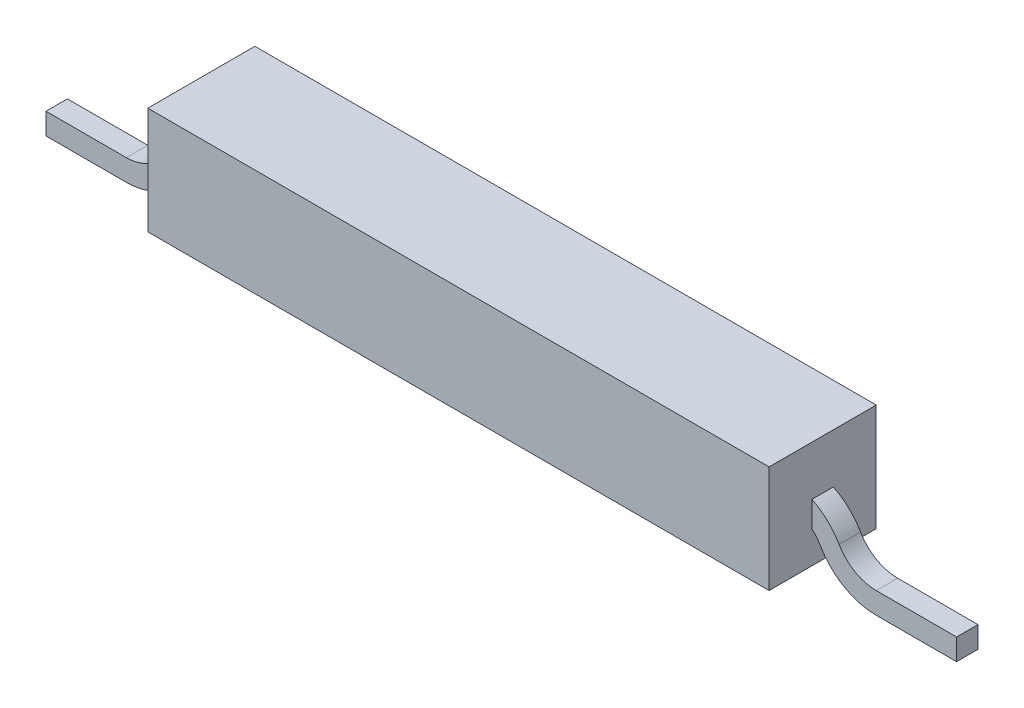
ISO-10303-21;
HEADER;
FILE_DESCRIPTION(('STEP AP214'),'2;1');
FILE_NAME('part.step','',(''),(''),'','','');
FILE_SCHEMA(('AUTOMOTIVE_DESIGN { 1 0 10303 214 1 1 1 1 }'));
ENDSEC;
DATA;
#1=APPLICATION_CONTEXT('core data for automotive mechanical design processes');
#2=APPLICATION_PROTOCOL_DEFINITION('international standard','automotive_design',2000,#1);
#3=PRODUCT_CONTEXT('',#1,'mechanical');
#4=PRODUCT('Part','Part','',(#3));
#5=PRODUCT_RELATED_PRODUCT_CATEGORY('part','',(#4));
#6=PRODUCT_DEFINITION_FORMATION('','',#4);
#7=PRODUCT_DEFINITION_CONTEXT('part definition',#1,'design');
#8=PRODUCT_DEFINITION('design','',#6,#7);
#9=PRODUCT_DEFINITION_SHAPE('','',#8);
#10=(LENGTH_UNIT() NAMED_UNIT(*) SI_UNIT(.MILLI.,.METRE.));
#11=(NAMED_UNIT(*) PLANE_ANGLE_UNIT() SI_UNIT($,.RADIAN.));
#12=(NAMED_UNIT(*) SI_UNIT($,.STERADIAN.) SOLID_ANGLE_UNIT());
#13=UNCERTAINTY_MEASURE_WITH_UNIT(LENGTH_MEASURE(1.E-05),#10,'distance_accuracy_value','');
#14=(GEOMETRIC_REPRESENTATION_CONTEXT(3) GLOBAL_UNCERTAINTY_ASSIGNED_CONTEXT((#13)) GLOBAL_UNIT_ASSIGNED_CONTEXT((#10,
#11,#12)) REPRESENTATION_CONTEXT('',''));
#15=CARTESIAN_POINT('',(0.,0.,0.));
#16=DIRECTION('',(0.,0.,1.));
#17=DIRECTION('',(1.,0.,0.));
#18=AXIS2_PLACEMENT_3D('',#15,#16,#17);
#19=CARTESIAN_POINT('',(5.8,-1.,-1.));
#20=DIRECTION('',(0.,0.,1.));
#21=DIRECTION('',(1.,0.,0.));
#22=AXIS2_PLACEMENT_3D('',#19,#20,#21);
#23=PLANE('',#22);
#24=DIRECTION('',(0.,1.,0.));
#25=VECTOR('',#24,1.);
#26=CARTESIAN_POINT('',(-5.8,-1.,-1.));
#27=LINE('',#26,#25);
#28=CARTESIAN_POINT('',(-5.8,-1.,-1.));
#29=VERTEX_POINT('',#28);
#30=CARTESIAN_POINT('',(-5.8,1.,-1.));
#31=VERTEX_POINT('',#30);
#32=EDGE_CURVE('E280',#29,#31,#27,.T.);
#33=ORIENTED_EDGE('',*,*,#32,.T.);
#34=DIRECTION('',(-1.,0.,0.));
#35=VECTOR('',#34,1.);
#36=CARTESIAN_POINT('',(5.8,1.,-1.));
#37=LINE('',#36,#35);
#38=CARTESIAN_POINT('',(5.8,1.,-1.));
#39=VERTEX_POINT('',#38);
#40=EDGE_CURVE('E307',#39,#31,#37,.T.);
#41=ORIENTED_EDGE('',*,*,#40,.F.);
#42=DIRECTION('',(0.,1.,0.));
#43=VECTOR('',#42,1.);
#44=CARTESIAN_POINT('',(5.8,-1.,-1.));
#45=LINE('',#44,#43);
#46=CARTESIAN_POINT('',(5.8,-1.,-1.));
#47=VERTEX_POINT('',#46);
#48=EDGE_CURVE('E281',#47,#39,#45,.T.);
#49=ORIENTED_EDGE('',*,*,#48,.F.);
#50=DIRECTION('',(-1.,0.,0.));
#51=VECTOR('',#50,1.);
#52=CARTESIAN_POINT('',(5.8,-1.,-1.));
#53=LINE('',#52,#51);
#54=EDGE_CURVE('E291',#47,#29,#53,.T.);
#55=ORIENTED_EDGE('',*,*,#54,.T.);
#56=EDGE_LOOP('',(#33,#41,#49,#55));
#57=FACE_BOUND('',#56,.T.);
#58=ADVANCED_FACE('F33',(#57),#23,.F.);
#59=CARTESIAN_POINT('',(5.8,1.,1.));
#60=DIRECTION('',(0.,-1.,0.));
#61=DIRECTION('',(0.,0.,-1.));
#62=AXIS2_PLACEMENT_3D('',#59,#60,#61);
#63=PLANE('',#62);
#64=DIRECTION('',(0.,0.,1.));
#65=VECTOR('',#64,1.);
#66=CARTESIAN_POINT('',(-5.8,1.,1.));
#67=LINE('',#66,#65);
#68=CARTESIAN_POINT('',(-5.8,1.,1.));
#69=VERTEX_POINT('',#68);
#70=EDGE_CURVE('E294',#31,#69,#67,.T.);
#71=ORIENTED_EDGE('',*,*,#70,.T.);
#72=DIRECTION('',(-1.,0.,0.));
#73=VECTOR('',#72,1.);
#74=CARTESIAN_POINT('',(5.8,1.,1.));
#75=LINE('',#74,#73);
#76=CARTESIAN_POINT('',(5.8,1.,1.));
#77=VERTEX_POINT('',#76);
#78=EDGE_CURVE('E304',#77,#69,#75,.T.);
#79=ORIENTED_EDGE('',*,*,#78,.F.);
#80=DIRECTION('',(0.,0.,1.));
#81=VECTOR('',#80,1.);
#82=CARTESIAN_POINT('',(5.8,1.,1.));
#83=LINE('',#82,#81);
#84=EDGE_CURVE('E284',#39,#77,#83,.T.);
#85=ORIENTED_EDGE('',*,*,#84,.F.);
#86=ORIENTED_EDGE('',*,*,#40,.T.);
#87=EDGE_LOOP('',(#71,#79,#85,#86));
#88=FACE_BOUND('',#87,.T.);
#89=ADVANCED_FACE('F359',(#88),#63,.F.);
#90=CARTESIAN_POINT('',(5.8,-1.,1.));
#91=DIRECTION('',(0.,0.,-1.));
#92=DIRECTION('',(-1.,0.,0.));
#93=AXIS2_PLACEMENT_3D('',#90,#91,#92);
#94=PLANE('',#93);
#95=DIRECTION('',(0.,-1.,0.));
#96=VECTOR('',#95,1.);
#97=CARTESIAN_POINT('',(-5.8,-1.,1.));
#98=LINE('',#97,#96);
#99=CARTESIAN_POINT('',(-5.8,-1.,1.));
#100=VERTEX_POINT('',#99);
#101=EDGE_CURVE('E296',#69,#100,#98,.T.);
#102=ORIENTED_EDGE('',*,*,#101,.T.);
#103=DIRECTION('',(-1.,0.,0.));
#104=VECTOR('',#103,1.);
#105=CARTESIAN_POINT('',(5.8,-1.,1.));
#106=LINE('',#105,#104);
#107=CARTESIAN_POINT('',(5.8,-1.,1.));
#108=VERTEX_POINT('',#107);
#109=EDGE_CURVE('E301',#108,#100,#106,.T.);
#110=ORIENTED_EDGE('',*,*,#109,.F.);
#111=DIRECTION('',(0.,-1.,0.));
#112=VECTOR('',#111,1.);
#113=CARTESIAN_POINT('',(5.8,-1.,1.));
#114=LINE('',#113,#112);
#115=EDGE_CURVE('E287',#77,#108,#114,.T.);
#116=ORIENTED_EDGE('',*,*,#115,.F.);
#117=ORIENTED_EDGE('',*,*,#78,.T.);
#118=EDGE_LOOP('',(#102,#110,#116,#117));
#119=FACE_BOUND('',#118,.T.);
#120=ADVANCED_FACE('F364',(#119),#94,.F.);
#121=CARTESIAN_POINT('',(5.8,-1.,1.));
#122=DIRECTION('',(0.,1.,0.));
#123=DIRECTION('',(0.,0.,1.));
#124=AXIS2_PLACEMENT_3D('',#121,#122,#123);
#125=PLANE('',#124);
#126=DIRECTION('',(0.,0.,-1.));
#127=VECTOR('',#126,1.);
#128=CARTESIAN_POINT('',(-5.8,-1.,1.));
#129=LINE('',#128,#127);
#130=EDGE_CURVE('E285',#100,#29,#129,.T.);
#131=ORIENTED_EDGE('',*,*,#130,.T.);
#132=ORIENTED_EDGE('',*,*,#54,.F.);
#133=DIRECTION('',(0.,0.,-1.));
#134=VECTOR('',#133,1.);
#135=CARTESIAN_POINT('',(5.8,-1.,1.));
#136=LINE('',#135,#134);
#137=EDGE_CURVE('E289',#108,#47,#136,.T.);
#138=ORIENTED_EDGE('',*,*,#137,.F.);
#139=ORIENTED_EDGE('',*,*,#109,.T.);
#140=EDGE_LOOP('',(#131,#132,#138,#139));
#141=FACE_BOUND('',#140,.T.);
#142=ADVANCED_FACE('F379',(#141),#125,.F.);
#143=CARTESIAN_POINT('',(5.8,0.,0.));
#144=DIRECTION('',(-1.,0.,0.));
#145=DIRECTION('',(0.,0.,1.));
#146=AXIS2_PLACEMENT_3D('',#143,#144,#145);
#147=PLANE('',#146);
#148=DIRECTION('',(0.,0.,1.));
#149=VECTOR('',#148,1.);
#150=CARTESIAN_POINT('',(5.8,-0.402570558002616,0.));
#151=LINE('',#150,#149);
#152=CARTESIAN_POINT('',(5.8,-0.402570558002616,0.2));
#153=VERTEX_POINT('',#152);
#154=CARTESIAN_POINT('',(5.8,-0.402570558002616,-0.2));
#155=VERTEX_POINT('',#154);
#156=EDGE_CURVE('E40',#153,#155,#151,.F.);
#157=ORIENTED_EDGE('',*,*,#156,.F.);
#158=DIRECTION('',(0.,1.,0.));
#159=VECTOR('',#158,1.);
#160=CARTESIAN_POINT('',(5.8,0.,0.2));
#161=LINE('',#160,#159);
#162=CARTESIAN_POINT('',(5.8,0.0756030579006828,0.2));
#163=VERTEX_POINT('',#162);
#164=EDGE_CURVE('E277',#153,#163,#161,.T.);
#165=ORIENTED_EDGE('',*,*,#164,.T.);
#166=DIRECTION('',(0.,0.,1.));
#167=VECTOR('',#166,1.);
#168=CARTESIAN_POINT('',(5.8,0.0756030579006828,0.));
#169=LINE('',#168,#167);
#170=CARTESIAN_POINT('',(5.8,0.0756030579006828,-0.2));
#171=VERTEX_POINT('',#170);
#172=EDGE_CURVE('E11',#171,#163,#169,.T.);
#173=ORIENTED_EDGE('',*,*,#172,.F.);
#174=DIRECTION('',(0.,-1.,0.));
#175=VECTOR('',#174,1.);
#176=CARTESIAN_POINT('',(5.8,0.,-0.2));
#177=LINE('',#176,#175);
#178=EDGE_CURVE('E274',#171,#155,#177,.T.);
#179=ORIENTED_EDGE('',*,*,#178,.T.);
#180=EDGE_LOOP('',(#157,#165,#173,#179));
#181=FACE_BOUND('',#180,.T.);
#182=ORIENTED_EDGE('',*,*,#48,.T.);
#183=ORIENTED_EDGE('',*,*,#84,.T.);
#184=ORIENTED_EDGE('',*,*,#115,.T.);
#185=ORIENTED_EDGE('',*,*,#137,.T.);
#186=EDGE_LOOP('',(#182,#183,#184,#185));
#187=FACE_BOUND('',#186,.T.);
#188=ADVANCED_FACE('F322',(#181,#187),#147,.F.);
#189=CARTESIAN_POINT('',(-5.8,0.,0.));
#190=DIRECTION('',(-1.,0.,0.));
#191=DIRECTION('',(0.,0.,1.));
#192=AXIS2_PLACEMENT_3D('',#189,#190,#191);
#193=PLANE('',#192);
#194=DIRECTION('',(0.,1.,0.));
#195=VECTOR('',#194,1.);
#196=CARTESIAN_POINT('',(-5.8,0.,0.2));
#197=LINE('',#196,#195);
#198=CARTESIAN_POINT('',(-5.8,-0.402570558002618,0.2));
#199=VERTEX_POINT('',#198);
#200=CARTESIAN_POINT('',(-5.8,0.0756030579006813,0.2));
#201=VERTEX_POINT('',#200);
#202=EDGE_CURVE('E316',#199,#201,#197,.T.);
#203=ORIENTED_EDGE('',*,*,#202,.F.);
#204=DIRECTION('',(0.,0.,1.));
#205=VECTOR('',#204,1.);
#206=CARTESIAN_POINT('',(-5.8,-0.402570558002618,0.));
#207=LINE('',#206,#205);
#208=CARTESIAN_POINT('',(-5.8,-0.402570558002618,-0.2));
#209=VERTEX_POINT('',#208);
#210=EDGE_CURVE('E313',#199,#209,#207,.F.);
#211=ORIENTED_EDGE('',*,*,#210,.T.);
#212=DIRECTION('',(0.,-1.,0.));
#213=VECTOR('',#212,1.);
#214=CARTESIAN_POINT('',(-5.8,0.,-0.2));
#215=LINE('',#214,#213);
#216=CARTESIAN_POINT('',(-5.8,0.0756030579006813,-0.2));
#217=VERTEX_POINT('',#216);
#218=EDGE_CURVE('E310',#217,#209,#215,.T.);
#219=ORIENTED_EDGE('',*,*,#218,.F.);
#220=DIRECTION('',(0.,0.,1.));
#221=VECTOR('',#220,1.);
#222=CARTESIAN_POINT('',(-5.8,0.0756030579006813,0.));
#223=LINE('',#222,#221);
#224=EDGE_CURVE('E55',#217,#201,#223,.T.);
#225=ORIENTED_EDGE('',*,*,#224,.T.);
#226=EDGE_LOOP('',(#203,#211,#219,#225));
#227=FACE_BOUND('',#226,.T.);
#228=ORIENTED_EDGE('',*,*,#32,.F.);
#229=ORIENTED_EDGE('',*,*,#130,.F.);
#230=ORIENTED_EDGE('',*,*,#101,.F.);
#231=ORIENTED_EDGE('',*,*,#70,.F.);
#232=EDGE_LOOP('',(#228,#229,#230,#231));
#233=FACE_BOUND('',#232,.T.);
#234=ADVANCED_FACE('F372',(#227,#233),#193,.T.);
#235=CARTESIAN_POINT('',(-7.,0.,0.));
#236=DIRECTION('',(0.,0.,-1.));
#237=DIRECTION('',(-1.,0.,0.));
#238=AXIS2_PLACEMENT_3D('',#235,#236,#237);
#239=CYLINDRICAL_SURFACE('',#238,0.8);
#240=DIRECTION('',(0.,0.,1.));
#241=VECTOR('',#240,1.);
#242=CARTESIAN_POINT('',(-6.30717967697245,-0.400000000000003,-0.2));
#243=LINE('',#242,#241);
#244=CARTESIAN_POINT('',(-6.30717967697245,-0.400000000000003,-0.2));
#245=VERTEX_POINT('',#244);
#246=CARTESIAN_POINT('',(-6.30717967697245,-0.400000000000003,0.2));
#247=VERTEX_POINT('',#246);
#248=EDGE_CURVE('E225',#245,#247,#243,.T.);
#249=ORIENTED_EDGE('',*,*,#248,.F.);
#250=CARTESIAN_POINT('',(-7.,0.,-0.2));
#251=DIRECTION('',(0.,0.,-1.));
#252=DIRECTION('',(-1.,0.,0.));
#253=AXIS2_PLACEMENT_3D('',#250,#251,#252);
#254=CIRCLE('',#253,0.8);
#255=CARTESIAN_POINT('',(-7.,-0.800000000000003,-0.2));
#256=VERTEX_POINT('',#255);
#257=EDGE_CURVE('E248',#245,#256,#254,.T.);
#258=ORIENTED_EDGE('',*,*,#257,.T.);
#259=DIRECTION('',(0.,0.,1.));
#260=VECTOR('',#259,1.);
#261=CARTESIAN_POINT('',(-7.,-0.800000000000003,-0.2));
#262=LINE('',#261,#260);
#263=CARTESIAN_POINT('',(-7.,-0.800000000000003,0.2));
#264=VERTEX_POINT('',#263);
#265=EDGE_CURVE('E239',#256,#264,#262,.T.);
#266=ORIENTED_EDGE('',*,*,#265,.T.);
#267=CARTESIAN_POINT('',(-7.,0.,0.2));
#268=DIRECTION('',(0.,0.,-1.));
#269=DIRECTION('',(-1.,0.,0.));
#270=AXIS2_PLACEMENT_3D('',#267,#268,#269);
#271=CIRCLE('',#270,0.8);
#272=EDGE_CURVE('E251',#247,#264,#271,.T.);
#273=ORIENTED_EDGE('',*,*,#272,.F.);
#274=EDGE_LOOP('',(#249,#258,#266,#273));
#275=FACE_BOUND('',#274,.T.);
#276=ADVANCED_FACE('F390',(#275),#239,.F.);
#277=CARTESIAN_POINT('',(-7.,-0.800000000000003,-0.2));
#278=DIRECTION('',(0.,-1.,0.));
#279=DIRECTION('',(1.,0.,0.));
#280=AXIS2_PLACEMENT_3D('',#277,#278,#279);
#281=PLANE('',#280);
#282=ORIENTED_EDGE('',*,*,#265,.F.);
#283=DIRECTION('',(-1.,0.,0.));
#284=VECTOR('',#283,1.);
#285=CARTESIAN_POINT('',(-7.,-0.800000000000003,-0.2));
#286=LINE('',#285,#284);
#287=CARTESIAN_POINT('',(-8.5,-0.800000000000003,-0.2));
#288=VERTEX_POINT('',#287);
#289=EDGE_CURVE('E268',#256,#288,#286,.T.);
#290=ORIENTED_EDGE('',*,*,#289,.T.);
#291=DIRECTION('',(0.,0.,1.));
#292=VECTOR('',#291,1.);
#293=CARTESIAN_POINT('',(-8.5,-0.800000000000003,-0.2));
#294=LINE('',#293,#292);
#295=CARTESIAN_POINT('',(-8.5,-0.800000000000003,0.2));
#296=VERTEX_POINT('',#295);
#297=EDGE_CURVE('E260',#288,#296,#294,.T.);
#298=ORIENTED_EDGE('',*,*,#297,.T.);
#299=DIRECTION('',(-1.,0.,0.));
#300=VECTOR('',#299,1.);
#301=CARTESIAN_POINT('',(-7.,-0.800000000000003,0.2));
#302=LINE('',#301,#300);
#303=EDGE_CURVE('E271',#264,#296,#302,.T.);
#304=ORIENTED_EDGE('',*,*,#303,.F.);
#305=EDGE_LOOP('',(#282,#290,#298,#304));
#306=FACE_BOUND('',#305,.T.);
#307=ADVANCED_FACE('F393',(#306),#281,.F.);
#308=CARTESIAN_POINT('',(-8.5,0.,0.));
#309=DIRECTION('',(-1.,0.,0.));
#310=DIRECTION('',(0.,0.,1.));
#311=AXIS2_PLACEMENT_3D('',#308,#309,#310);
#312=PLANE('',#311);
#313=DIRECTION('',(0.,-1.,0.));
#314=VECTOR('',#313,1.);
#315=CARTESIAN_POINT('',(-8.5,-0.800000000000003,0.2));
#316=LINE('',#315,#314);
#317=CARTESIAN_POINT('',(-8.5,-1.2,0.2));
#318=VERTEX_POINT('',#317);
#319=EDGE_CURVE('E254',#296,#318,#316,.T.);
#320=ORIENTED_EDGE('',*,*,#319,.F.);
#321=ORIENTED_EDGE('',*,*,#297,.F.);
#322=DIRECTION('',(0.,1.,0.));
#323=VECTOR('',#322,1.);
#324=CARTESIAN_POINT('',(-8.5,-0.800000000000003,-0.2));
#325=LINE('',#324,#323);
#326=CARTESIAN_POINT('',(-8.5,-1.2,-0.2));
#327=VERTEX_POINT('',#326);
#328=EDGE_CURVE('E258',#327,#288,#325,.T.);
#329=ORIENTED_EDGE('',*,*,#328,.F.);
#330=DIRECTION('',(0.,0.,-1.));
#331=VECTOR('',#330,1.);
#332=CARTESIAN_POINT('',(-8.5,-1.2,-0.2));
#333=LINE('',#332,#331);
#334=EDGE_CURVE('E256',#318,#327,#333,.T.);
#335=ORIENTED_EDGE('',*,*,#334,.F.);
#336=EDGE_LOOP('',(#320,#321,#329,#335));
#337=FACE_BOUND('',#336,.T.);
#338=ADVANCED_FACE('F396',(#337),#312,.T.);
#339=CARTESIAN_POINT('',(-7.,-1.2,-0.2));
#340=DIRECTION('',(0.,1.,0.));
#341=DIRECTION('',(-1.,0.,0.));
#342=AXIS2_PLACEMENT_3D('',#339,#340,#341);
#343=PLANE('',#342);
#344=DIRECTION('',(0.,0.,-1.));
#345=VECTOR('',#344,1.);
#346=CARTESIAN_POINT('',(-7.,-1.2,-0.2));
#347=LINE('',#346,#345);
#348=CARTESIAN_POINT('',(-7.,-1.2,0.2));
#349=VERTEX_POINT('',#348);
#350=CARTESIAN_POINT('',(-7.,-1.2,-0.2));
#351=VERTEX_POINT('',#350);
#352=EDGE_CURVE('E236',#349,#351,#347,.T.);
#353=ORIENTED_EDGE('',*,*,#352,.F.);
#354=DIRECTION('',(-1.,0.,0.));
#355=VECTOR('',#354,1.);
#356=CARTESIAN_POINT('',(-7.,-1.2,0.2));
#357=LINE('',#356,#355);
#358=EDGE_CURVE('E262',#349,#318,#357,.T.);
#359=ORIENTED_EDGE('',*,*,#358,.T.);
#360=ORIENTED_EDGE('',*,*,#334,.T.);
#361=DIRECTION('',(-1.,0.,0.));
#362=VECTOR('',#361,1.);
#363=CARTESIAN_POINT('',(-7.,-1.2,-0.2));
#364=LINE('',#363,#362);
#365=EDGE_CURVE('E265',#351,#327,#364,.T.);
#366=ORIENTED_EDGE('',*,*,#365,.F.);
#367=EDGE_LOOP('',(#353,#359,#360,#366));
#368=FACE_BOUND('',#367,.T.);
#369=ADVANCED_FACE('F398',(#368),#343,.F.);
#370=CARTESIAN_POINT('',(-7.,0.,0.));
#371=DIRECTION('',(0.,0.,-1.));
#372=DIRECTION('',(-1.,0.,0.));
#373=AXIS2_PLACEMENT_3D('',#370,#371,#372);
#374=CYLINDRICAL_SURFACE('',#373,1.2);
#375=DIRECTION('',(0.,0.,-1.));
#376=VECTOR('',#375,1.);
#377=CARTESIAN_POINT('',(-5.96076951545867,-0.600000000000003,-0.2));
#378=LINE('',#377,#376);
#379=CARTESIAN_POINT('',(-5.96076951545867,-0.600000000000003,0.2));
#380=VERTEX_POINT('',#379);
#381=CARTESIAN_POINT('',(-5.96076951545867,-0.600000000000003,-0.2));
#382=VERTEX_POINT('',#381);
#383=EDGE_CURVE('E222',#380,#382,#378,.T.);
#384=ORIENTED_EDGE('',*,*,#383,.F.);
#385=CARTESIAN_POINT('',(-7.,0.,0.2));
#386=DIRECTION('',(0.,0.,-1.));
#387=DIRECTION('',(-1.,0.,0.));
#388=AXIS2_PLACEMENT_3D('',#385,#386,#387);
#389=CIRCLE('',#388,1.2);
#390=EDGE_CURVE('E242',#380,#349,#389,.T.);
#391=ORIENTED_EDGE('',*,*,#390,.T.);
#392=ORIENTED_EDGE('',*,*,#352,.T.);
#393=CARTESIAN_POINT('',(-7.,0.,-0.2));
#394=DIRECTION('',(0.,0.,-1.));
#395=DIRECTION('',(-1.,0.,0.));
#396=AXIS2_PLACEMENT_3D('',#393,#394,#395);
#397=CIRCLE('',#396,1.2);
#398=EDGE_CURVE('E245',#382,#351,#397,.T.);
#399=ORIENTED_EDGE('',*,*,#398,.F.);
#400=EDGE_LOOP('',(#384,#391,#392,#399));
#401=FACE_BOUND('',#400,.T.);
#402=ADVANCED_FACE('F401',(#401),#374,.T.);
#403=CARTESIAN_POINT('',(7.,-0.800000000000001,-0.2));
#404=DIRECTION('',(0.,0.,-1.));
#405=DIRECTION('',(0.,1.,0.));
#406=AXIS2_PLACEMENT_3D('',#403,#404,#405);
#407=PLANE('',#406);
#408=CARTESIAN_POINT('',(-5.26794919243113,-1.,-0.2));
#409=DIRECTION('',(0.,0.,1.));
#410=DIRECTION('',(1.,0.,0.));
#411=AXIS2_PLACEMENT_3D('',#408,#409,#410);
#412=CIRCLE('',#411,1.19999999999999);
#413=EDGE_CURVE('E232',#217,#245,#412,.T.);
#414=ORIENTED_EDGE('',*,*,#413,.F.);
#415=ORIENTED_EDGE('',*,*,#218,.T.);
#416=CARTESIAN_POINT('',(-5.26794919243113,-1.,-0.2));
#417=DIRECTION('',(0.,0.,1.));
#418=DIRECTION('',(1.,0.,0.));
#419=AXIS2_PLACEMENT_3D('',#416,#417,#418);
#420=CIRCLE('',#419,0.799999999999995);
#421=EDGE_CURVE('E230',#209,#382,#420,.T.);
#422=ORIENTED_EDGE('',*,*,#421,.T.);
#423=ORIENTED_EDGE('',*,*,#398,.T.);
#424=ORIENTED_EDGE('',*,*,#365,.T.);
#425=ORIENTED_EDGE('',*,*,#328,.T.);
#426=ORIENTED_EDGE('',*,*,#289,.F.);
#427=ORIENTED_EDGE('',*,*,#257,.F.);
#428=EDGE_LOOP('',(#414,#415,#422,#423,#424,#425,#426,#427));
#429=FACE_BOUND('',#428,.T.);
#430=ADVANCED_FACE('F408',(#429),#407,.T.);
#431=CARTESIAN_POINT('',(7.,-0.800000000000001,0.2));
#432=DIRECTION('',(0.,0.,1.));
#433=DIRECTION('',(1.,0.,0.));
#434=AXIS2_PLACEMENT_3D('',#431,#432,#433);
#435=PLANE('',#434);
#436=CARTESIAN_POINT('',(-5.26794919243113,-1.,0.2));
#437=DIRECTION('',(0.,0.,1.));
#438=DIRECTION('',(1.,0.,0.));
#439=AXIS2_PLACEMENT_3D('',#436,#437,#438);
#440=CIRCLE('',#439,0.799999999999995);
#441=EDGE_CURVE('E228',#199,#380,#440,.T.);
#442=ORIENTED_EDGE('',*,*,#441,.F.);
#443=ORIENTED_EDGE('',*,*,#202,.T.);
#444=CARTESIAN_POINT('',(-5.26794919243113,-1.,0.2));
#445=DIRECTION('',(0.,0.,1.));
#446=DIRECTION('',(1.,0.,0.));
#447=AXIS2_PLACEMENT_3D('',#444,#445,#446);
#448=CIRCLE('',#447,1.19999999999999);
#449=EDGE_CURVE('E234',#201,#247,#448,.T.);
#450=ORIENTED_EDGE('',*,*,#449,.T.);
#451=ORIENTED_EDGE('',*,*,#272,.T.);
#452=ORIENTED_EDGE('',*,*,#303,.T.);
#453=ORIENTED_EDGE('',*,*,#319,.T.);
#454=ORIENTED_EDGE('',*,*,#358,.F.);
#455=ORIENTED_EDGE('',*,*,#390,.F.);
#456=EDGE_LOOP('',(#442,#443,#450,#451,#452,#453,#454,#455));
#457=FACE_BOUND('',#456,.T.);
#458=ADVANCED_FACE('F417',(#457),#435,.T.);
#459=CARTESIAN_POINT('',(-5.26794919243113,-1.,0.));
#460=DIRECTION('',(0.,0.,1.));
#461=DIRECTION('',(1.,0.,0.));
#462=AXIS2_PLACEMENT_3D('',#459,#460,#461);
#463=CYLINDRICAL_SURFACE('',#462,0.799999999999995);
#464=ORIENTED_EDGE('',*,*,#210,.F.);
#465=ORIENTED_EDGE('',*,*,#441,.T.);
#466=ORIENTED_EDGE('',*,*,#383,.T.);
#467=ORIENTED_EDGE('',*,*,#421,.F.);
#468=EDGE_LOOP('',(#464,#465,#466,#467));
#469=FACE_BOUND('',#468,.T.);
#470=ADVANCED_FACE('F413',(#469),#463,.F.);
#471=CARTESIAN_POINT('',(-5.26794919243113,-1.,0.));
#472=DIRECTION('',(0.,0.,1.));
#473=DIRECTION('',(1.,0.,0.));
#474=AXIS2_PLACEMENT_3D('',#471,#472,#473);
#475=CYLINDRICAL_SURFACE('',#474,1.19999999999999);
#476=ORIENTED_EDGE('',*,*,#224,.F.);
#477=ORIENTED_EDGE('',*,*,#413,.T.);
#478=ORIENTED_EDGE('',*,*,#248,.T.);
#479=ORIENTED_EDGE('',*,*,#449,.F.);
#480=EDGE_LOOP('',(#476,#477,#478,#479));
#481=FACE_BOUND('',#480,.T.);
#482=ADVANCED_FACE('F410',(#481),#475,.T.);
#483=CARTESIAN_POINT('',(5.26794919243113,-1.,0.));
#484=DIRECTION('',(0.,0.,1.));
#485=DIRECTION('',(1.,0.,0.));
#486=AXIS2_PLACEMENT_3D('',#483,#484,#485);
#487=CYLINDRICAL_SURFACE('',#486,1.2);
#488=CARTESIAN_POINT('',(5.26794919243113,-1.,-0.2));
#489=DIRECTION('',(0.,0.,1.));
#490=DIRECTION('',(1.,0.,0.));
#491=AXIS2_PLACEMENT_3D('',#488,#489,#490);
#492=CIRCLE('',#491,1.2);
#493=CARTESIAN_POINT('',(6.30717967697245,-0.400000000000003,-0.2));
#494=VERTEX_POINT('',#493);
#495=EDGE_CURVE('E216',#494,#171,#492,.T.);
#496=ORIENTED_EDGE('',*,*,#495,.T.);
#497=ORIENTED_EDGE('',*,*,#172,.T.);
#498=CARTESIAN_POINT('',(5.26794919243113,-1.,0.2));
#499=DIRECTION('',(0.,0.,1.));
#500=DIRECTION('',(1.,0.,0.));
#501=AXIS2_PLACEMENT_3D('',#498,#499,#500);
#502=CIRCLE('',#501,1.2);
#503=CARTESIAN_POINT('',(6.30717967697245,-0.400000000000003,0.2));
#504=VERTEX_POINT('',#503);
#505=EDGE_CURVE('E219',#504,#163,#502,.T.);
#506=ORIENTED_EDGE('',*,*,#505,.F.);
#507=DIRECTION('',(0.,0.,1.));
#508=VECTOR('',#507,1.);
#509=CARTESIAN_POINT('',(6.30717967697245,-0.400000000000003,-0.2));
#510=LINE('',#509,#508);
#511=EDGE_CURVE('E180',#494,#504,#510,.T.);
#512=ORIENTED_EDGE('',*,*,#511,.F.);
#513=EDGE_LOOP('',(#496,#497,#506,#512));
#514=FACE_BOUND('',#513,.T.);
#515=ADVANCED_FACE('F327',(#514),#487,.T.);
#516=CARTESIAN_POINT('',(5.26794919243113,-1.,0.));
#517=DIRECTION('',(0.,0.,1.));
#518=DIRECTION('',(1.,0.,0.));
#519=AXIS2_PLACEMENT_3D('',#516,#517,#518);
#520=CYLINDRICAL_SURFACE('',#519,0.799999999999996);
#521=CARTESIAN_POINT('',(5.26794919243113,-1.,0.2));
#522=DIRECTION('',(0.,0.,1.));
#523=DIRECTION('',(1.,0.,0.));
#524=AXIS2_PLACEMENT_3D('',#521,#522,#523);
#525=CIRCLE('',#524,0.799999999999996);
#526=CARTESIAN_POINT('',(5.96076951545868,-0.600000000000003,0.2));
#527=VERTEX_POINT('',#526);
#528=EDGE_CURVE('E175',#527,#153,#525,.T.);
#529=ORIENTED_EDGE('',*,*,#528,.T.);
#530=ORIENTED_EDGE('',*,*,#156,.T.);
#531=CARTESIAN_POINT('',(5.26794919243113,-1.,-0.2));
#532=DIRECTION('',(0.,0.,1.));
#533=DIRECTION('',(1.,0.,0.));
#534=AXIS2_PLACEMENT_3D('',#531,#532,#533);
#535=CIRCLE('',#534,0.799999999999996);
#536=CARTESIAN_POINT('',(5.96076951545868,-0.600000000000003,-0.2));
#537=VERTEX_POINT('',#536);
#538=EDGE_CURVE('E47',#537,#155,#535,.T.);
#539=ORIENTED_EDGE('',*,*,#538,.F.);
#540=DIRECTION('',(0.,0.,-1.));
#541=VECTOR('',#540,1.);
#542=CARTESIAN_POINT('',(5.96076951545868,-0.600000000000003,-0.2));
#543=LINE('',#542,#541);
#544=EDGE_CURVE('E202',#527,#537,#543,.T.);
#545=ORIENTED_EDGE('',*,*,#544,.F.);
#546=EDGE_LOOP('',(#529,#530,#539,#545));
#547=FACE_BOUND('',#546,.T.);
#548=ADVANCED_FACE('F319',(#547),#520,.F.);
#549=ORIENTED_EDGE('',*,*,#164,.F.);
#550=ORIENTED_EDGE('',*,*,#528,.F.);
#551=CARTESIAN_POINT('',(7.,0.,0.2));
#552=DIRECTION('',(0.,0.,-1.));
#553=DIRECTION('',(-1.,0.,0.));
#554=AXIS2_PLACEMENT_3D('',#551,#552,#553);
#555=CIRCLE('',#554,1.2);
#556=CARTESIAN_POINT('',(7.,-1.2,0.2));
#557=VERTEX_POINT('',#556);
#558=EDGE_CURVE('E167',#557,#527,#555,.T.);
#559=ORIENTED_EDGE('',*,*,#558,.F.);
#560=DIRECTION('',(1.,0.,0.));
#561=VECTOR('',#560,1.);
#562=CARTESIAN_POINT('',(7.,-1.2,0.2));
#563=LINE('',#562,#561);
#564=CARTESIAN_POINT('',(8.5,-1.2,0.2));
#565=VERTEX_POINT('',#564);
#566=EDGE_CURVE('E172',#557,#565,#563,.T.);
#567=ORIENTED_EDGE('',*,*,#566,.T.);
#568=DIRECTION('',(0.,-1.,0.));
#569=VECTOR('',#568,1.);
#570=CARTESIAN_POINT('',(8.5,-0.800000000000002,0.2));
#571=LINE('',#570,#569);
#572=CARTESIAN_POINT('',(8.5,-0.800000000000002,0.2));
#573=VERTEX_POINT('',#572);
#574=EDGE_CURVE('E347',#573,#565,#571,.T.);
#575=ORIENTED_EDGE('',*,*,#574,.F.);
#576=DIRECTION('',(1.,0.,0.));
#577=VECTOR('',#576,1.);
#578=CARTESIAN_POINT('',(7.,-0.800000000000001,0.2));
#579=LINE('',#578,#577);
#580=CARTESIAN_POINT('',(7.,-0.800000000000001,0.2));
#581=VERTEX_POINT('',#580);
#582=EDGE_CURVE('E204',#581,#573,#579,.T.);
#583=ORIENTED_EDGE('',*,*,#582,.F.);
#584=CARTESIAN_POINT('',(7.,0.,0.2));
#585=DIRECTION('',(0.,0.,-1.));
#586=DIRECTION('',(-1.,0.,0.));
#587=AXIS2_PLACEMENT_3D('',#584,#585,#586);
#588=CIRCLE('',#587,0.799999999999998);
#589=EDGE_CURVE('E211',#581,#504,#588,.T.);
#590=ORIENTED_EDGE('',*,*,#589,.T.);
#591=ORIENTED_EDGE('',*,*,#505,.T.);
#592=EDGE_LOOP('',(#549,#550,#559,#567,#575,#583,#590,#591));
#593=FACE_BOUND('',#592,.T.);
#594=ADVANCED_FACE('F169',(#593),#435,.T.);
#595=ORIENTED_EDGE('',*,*,#178,.F.);
#596=ORIENTED_EDGE('',*,*,#495,.F.);
#597=CARTESIAN_POINT('',(7.,0.,-0.2));
#598=DIRECTION('',(0.,0.,-1.));
#599=DIRECTION('',(-1.,0.,0.));
#600=AXIS2_PLACEMENT_3D('',#597,#598,#599);
#601=CIRCLE('',#600,0.799999999999998);
#602=CARTESIAN_POINT('',(7.,-0.800000000000001,-0.2));
#603=VERTEX_POINT('',#602);
#604=EDGE_CURVE('E208',#603,#494,#601,.T.);
#605=ORIENTED_EDGE('',*,*,#604,.F.);
#606=DIRECTION('',(1.,0.,0.));
#607=VECTOR('',#606,1.);
#608=CARTESIAN_POINT('',(7.,-0.800000000000001,-0.2));
#609=LINE('',#608,#607);
#610=CARTESIAN_POINT('',(8.5,-0.800000000000002,-0.2));
#611=VERTEX_POINT('',#610);
#612=EDGE_CURVE('E196',#603,#611,#609,.T.);
#613=ORIENTED_EDGE('',*,*,#612,.T.);
#614=DIRECTION('',(0.,1.,0.));
#615=VECTOR('',#614,1.);
#616=CARTESIAN_POINT('',(8.5,-0.800000000000002,-0.2));
#617=LINE('',#616,#615);
#618=CARTESIAN_POINT('',(8.5,-1.2,-0.2));
#619=VERTEX_POINT('',#618);
#620=EDGE_CURVE('E334',#619,#611,#617,.T.);
#621=ORIENTED_EDGE('',*,*,#620,.F.);
#622=DIRECTION('',(1.,0.,0.));
#623=VECTOR('',#622,1.);
#624=CARTESIAN_POINT('',(7.,-1.2,-0.2));
#625=LINE('',#624,#623);
#626=CARTESIAN_POINT('',(7.,-1.2,-0.2));
#627=VERTEX_POINT('',#626);
#628=EDGE_CURVE('E194',#627,#619,#625,.T.);
#629=ORIENTED_EDGE('',*,*,#628,.F.);
#630=CARTESIAN_POINT('',(7.,0.,-0.2));
#631=DIRECTION('',(0.,0.,-1.));
#632=DIRECTION('',(-1.,0.,0.));
#633=AXIS2_PLACEMENT_3D('',#630,#631,#632);
#634=CIRCLE('',#633,1.2);
#635=EDGE_CURVE('E179',#627,#537,#634,.T.);
#636=ORIENTED_EDGE('',*,*,#635,.T.);
#637=ORIENTED_EDGE('',*,*,#538,.T.);
#638=EDGE_LOOP('',(#595,#596,#605,#613,#621,#629,#636,#637));
#639=FACE_BOUND('',#638,.T.);
#640=ADVANCED_FACE('F324',(#639),#407,.T.);
#641=CARTESIAN_POINT('',(7.,0.,0.));
#642=DIRECTION('',(0.,0.,-1.));
#643=DIRECTION('',(-1.,0.,0.));
#644=AXIS2_PLACEMENT_3D('',#641,#642,#643);
#645=CYLINDRICAL_SURFACE('',#644,0.799999999999998);
#646=DIRECTION('',(0.,0.,1.));
#647=VECTOR('',#646,1.);
#648=CARTESIAN_POINT('',(7.,-0.800000000000001,-0.2));
#649=LINE('',#648,#647);
#650=EDGE_CURVE('E187',#603,#581,#649,.T.);
#651=ORIENTED_EDGE('',*,*,#650,.F.);
#652=ORIENTED_EDGE('',*,*,#604,.T.);
#653=ORIENTED_EDGE('',*,*,#511,.T.);
#654=ORIENTED_EDGE('',*,*,#589,.F.);
#655=EDGE_LOOP('',(#651,#652,#653,#654));
#656=FACE_BOUND('',#655,.T.);
#657=ADVANCED_FACE('F330',(#656),#645,.F.);
#658=CARTESIAN_POINT('',(7.,0.,0.));
#659=DIRECTION('',(0.,0.,-1.));
#660=DIRECTION('',(-1.,0.,0.));
#661=AXIS2_PLACEMENT_3D('',#658,#659,#660);
#662=CYLINDRICAL_SURFACE('',#661,1.2);
#663=DIRECTION('',(0.,0.,-1.));
#664=VECTOR('',#663,1.);
#665=CARTESIAN_POINT('',(7.,-1.2,-0.2));
#666=LINE('',#665,#664);
#667=EDGE_CURVE('E183',#557,#627,#666,.T.);
#668=ORIENTED_EDGE('',*,*,#667,.F.);
#669=ORIENTED_EDGE('',*,*,#558,.T.);
#670=ORIENTED_EDGE('',*,*,#544,.T.);
#671=ORIENTED_EDGE('',*,*,#635,.F.);
#672=EDGE_LOOP('',(#668,#669,#670,#671));
#673=FACE_BOUND('',#672,.T.);
#674=ADVANCED_FACE('F184',(#673),#662,.T.);
#675=CARTESIAN_POINT('',(7.,-0.800000000000001,-0.2));
#676=DIRECTION('',(0.,1.,0.));
#677=DIRECTION('',(-1.,0.,0.));
#678=AXIS2_PLACEMENT_3D('',#675,#676,#677);
#679=PLANE('',#678);
#680=DIRECTION('',(0.,0.,1.));
#681=VECTOR('',#680,1.);
#682=CARTESIAN_POINT('',(8.5,-0.800000000000002,-0.2));
#683=LINE('',#682,#681);
#684=EDGE_CURVE('E188',#611,#573,#683,.T.);
#685=ORIENTED_EDGE('',*,*,#684,.F.);
#686=ORIENTED_EDGE('',*,*,#612,.F.);
#687=ORIENTED_EDGE('',*,*,#650,.T.);
#688=ORIENTED_EDGE('',*,*,#582,.T.);
#689=EDGE_LOOP('',(#685,#686,#687,#688));
#690=FACE_BOUND('',#689,.T.);
#691=ADVANCED_FACE('F341',(#690),#679,.T.);
#692=CARTESIAN_POINT('',(7.,-1.2,-0.2));
#693=DIRECTION('',(0.,-1.,0.));
#694=DIRECTION('',(1.,0.,0.));
#695=AXIS2_PLACEMENT_3D('',#692,#693,#694);
#696=PLANE('',#695);
#697=DIRECTION('',(0.,0.,-1.));
#698=VECTOR('',#697,1.);
#699=CARTESIAN_POINT('',(8.5,-1.2,-0.2));
#700=LINE('',#699,#698);
#701=EDGE_CURVE('E192',#565,#619,#700,.T.);
#702=ORIENTED_EDGE('',*,*,#701,.F.);
#703=ORIENTED_EDGE('',*,*,#566,.F.);
#704=ORIENTED_EDGE('',*,*,#667,.T.);
#705=ORIENTED_EDGE('',*,*,#628,.T.);
#706=EDGE_LOOP('',(#702,#703,#704,#705));
#707=FACE_BOUND('',#706,.T.);
#708=ADVANCED_FACE('F190',(#707),#696,.T.);
#709=CARTESIAN_POINT('',(8.5,0.,0.));
#710=DIRECTION('',(-1.,0.,0.));
#711=DIRECTION('',(0.,0.,1.));
#712=AXIS2_PLACEMENT_3D('',#709,#710,#711);
#713=PLANE('',#712);
#714=ORIENTED_EDGE('',*,*,#574,.T.);
#715=ORIENTED_EDGE('',*,*,#701,.T.);
#716=ORIENTED_EDGE('',*,*,#620,.T.);
#717=ORIENTED_EDGE('',*,*,#684,.T.);
#718=EDGE_LOOP('',(#714,#715,#716,#717));
#719=FACE_BOUND('',#718,.T.);
#720=ADVANCED_FACE('F339',(#719),#713,.F.);
#721=CLOSED_SHELL('',(#58,#89,#120,#142,#188,#234,#276,#307,#338,#369,#402,#430,#458,#470,#482,
#515,#548,#594,#640,#657,#674,#691,#708,#720));
#722=MANIFOLD_SOLID_BREP('B2',#721);
#723=ADVANCED_BREP_SHAPE_REPRESENTATION('',(#18,#722),#14);
#724=SHAPE_DEFINITION_REPRESENTATION(#9,#723);
ENDSEC;
END-ISO-10303-21;
